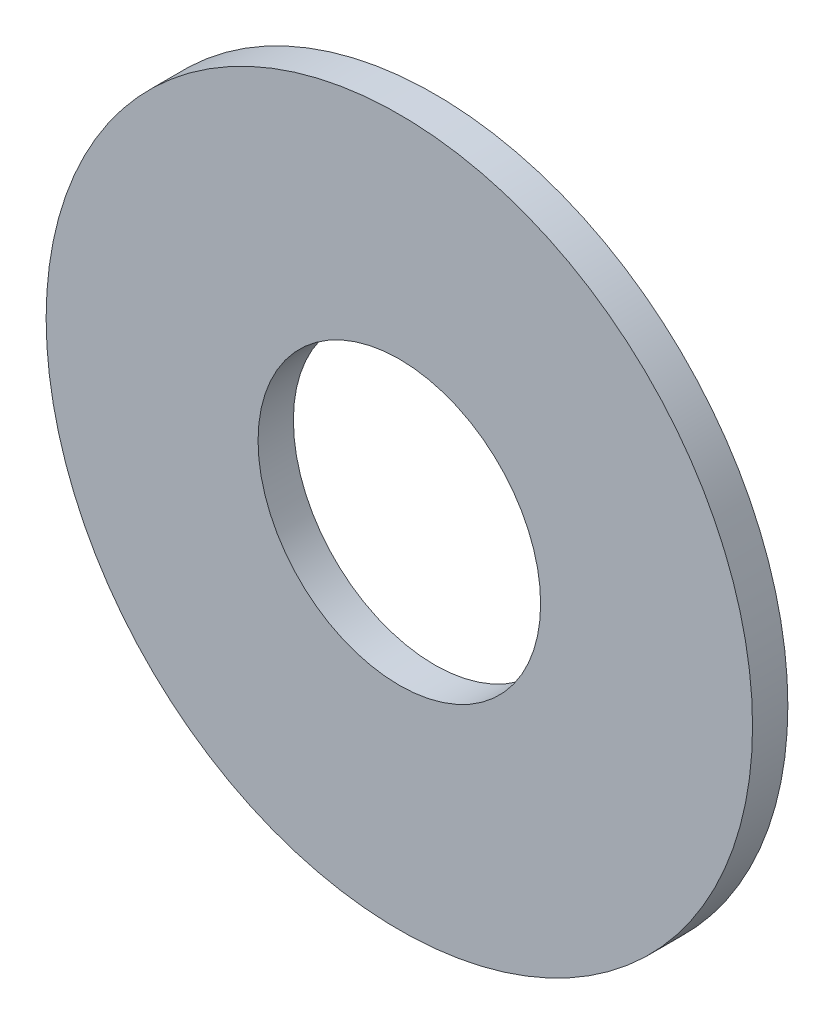
ISO-10303-21;
HEADER;
FILE_DESCRIPTION(('STEP AP214'),'2;1');
FILE_NAME('part.step','',(''),(''),'','','');
FILE_SCHEMA(('AUTOMOTIVE_DESIGN { 1 0 10303 214 1 1 1 1 }'));
ENDSEC;
DATA;
#1=APPLICATION_CONTEXT('core data for automotive mechanical design processes');
#2=APPLICATION_PROTOCOL_DEFINITION('international standard','automotive_design',2000,#1);
#3=PRODUCT_CONTEXT('',#1,'mechanical');
#4=PRODUCT('Part','Part','',(#3));
#5=PRODUCT_RELATED_PRODUCT_CATEGORY('part','',(#4));
#6=PRODUCT_DEFINITION_FORMATION('','',#4);
#7=PRODUCT_DEFINITION_CONTEXT('part definition',#1,'design');
#8=PRODUCT_DEFINITION('design','',#6,#7);
#9=PRODUCT_DEFINITION_SHAPE('','',#8);
#10=(LENGTH_UNIT() NAMED_UNIT(*) SI_UNIT(.MILLI.,.METRE.));
#11=(NAMED_UNIT(*) PLANE_ANGLE_UNIT() SI_UNIT($,.RADIAN.));
#12=(NAMED_UNIT(*) SI_UNIT($,.STERADIAN.) SOLID_ANGLE_UNIT());
#13=UNCERTAINTY_MEASURE_WITH_UNIT(LENGTH_MEASURE(1.E-05),#10,'distance_accuracy_value','');
#14=(GEOMETRIC_REPRESENTATION_CONTEXT(3) GLOBAL_UNCERTAINTY_ASSIGNED_CONTEXT((#13)) GLOBAL_UNIT_ASSIGNED_CONTEXT((#10,
#11,#12)) REPRESENTATION_CONTEXT('',''));
#15=CARTESIAN_POINT('',(0.,0.,0.));
#16=DIRECTION('',(0.,0.,1.));
#17=DIRECTION('',(1.,0.,0.));
#18=AXIS2_PLACEMENT_3D('',#15,#16,#17);
#19=CARTESIAN_POINT('',(0.,0.,1.));
#20=DIRECTION('',(0.,0.,1.));
#21=DIRECTION('',(1.,0.,0.));
#22=AXIS2_PLACEMENT_3D('',#19,#20,#21);
#23=PLANE('',#22);
#24=CARTESIAN_POINT('',(0.,0.,1.));
#25=DIRECTION('',(0.,0.,1.));
#26=DIRECTION('',(1.,0.,0.));
#27=AXIS2_PLACEMENT_3D('',#24,#25,#26);
#28=CIRCLE('',#27,10.);
#29=CARTESIAN_POINT('',(10.,0.,1.));
#30=VERTEX_POINT('',#29);
#31=EDGE_CURVE('E10',#30,#30,#28,.T.);
#32=ORIENTED_EDGE('',*,*,#31,.T.);
#33=EDGE_LOOP('',(#32));
#34=FACE_BOUND('',#33,.T.);
#35=CARTESIAN_POINT('',(0.,0.,1.));
#36=DIRECTION('',(0.,0.,1.));
#37=DIRECTION('',(1.,0.,0.));
#38=AXIS2_PLACEMENT_3D('',#35,#36,#37);
#39=CIRCLE('',#38,4.);
#40=CARTESIAN_POINT('',(4.,0.,1.));
#41=VERTEX_POINT('',#40);
#42=EDGE_CURVE('E42',#41,#41,#39,.T.);
#43=ORIENTED_EDGE('',*,*,#42,.F.);
#44=EDGE_LOOP('',(#43));
#45=FACE_BOUND('',#44,.T.);
#46=ADVANCED_FACE('F31',(#34,#45),#23,.T.);
#47=CARTESIAN_POINT('',(0.,0.,0.));
#48=DIRECTION('',(0.,0.,1.));
#49=DIRECTION('',(1.,0.,0.));
#50=AXIS2_PLACEMENT_3D('',#47,#48,#49);
#51=PLANE('',#50);
#52=CARTESIAN_POINT('',(0.,0.,0.));
#53=DIRECTION('',(0.,0.,1.));
#54=DIRECTION('',(1.,0.,0.));
#55=AXIS2_PLACEMENT_3D('',#52,#53,#54);
#56=CIRCLE('',#55,10.);
#57=CARTESIAN_POINT('',(10.,0.,0.));
#58=VERTEX_POINT('',#57);
#59=EDGE_CURVE('E35',#58,#58,#56,.T.);
#60=ORIENTED_EDGE('',*,*,#59,.F.);
#61=EDGE_LOOP('',(#60));
#62=FACE_BOUND('',#61,.T.);
#63=CARTESIAN_POINT('',(0.,0.,0.));
#64=DIRECTION('',(0.,0.,1.));
#65=DIRECTION('',(1.,0.,0.));
#66=AXIS2_PLACEMENT_3D('',#63,#64,#65);
#67=CIRCLE('',#66,4.);
#68=CARTESIAN_POINT('',(4.,0.,0.));
#69=VERTEX_POINT('',#68);
#70=EDGE_CURVE('E44',#69,#69,#67,.T.);
#71=ORIENTED_EDGE('',*,*,#70,.T.);
#72=EDGE_LOOP('',(#71));
#73=FACE_BOUND('',#72,.T.);
#74=ADVANCED_FACE('F54',(#62,#73),#51,.F.);
#75=CARTESIAN_POINT('',(0.,0.,1.));
#76=DIRECTION('',(0.,0.,-1.));
#77=DIRECTION('',(-1.,0.,0.));
#78=AXIS2_PLACEMENT_3D('',#75,#76,#77);
#79=CYLINDRICAL_SURFACE('',#78,10.);
#80=ORIENTED_EDGE('',*,*,#31,.F.);
#81=EDGE_LOOP('',(#80));
#82=FACE_BOUND('',#81,.T.);
#83=ORIENTED_EDGE('',*,*,#59,.T.);
#84=EDGE_LOOP('',(#83));
#85=FACE_BOUND('',#84,.T.);
#86=ADVANCED_FACE('F33',(#82,#85),#79,.T.);
#87=CARTESIAN_POINT('',(0.,0.,1.));
#88=DIRECTION('',(0.,0.,-1.));
#89=DIRECTION('',(-1.,0.,0.));
#90=AXIS2_PLACEMENT_3D('',#87,#88,#89);
#91=CYLINDRICAL_SURFACE('',#90,4.);
#92=ORIENTED_EDGE('',*,*,#42,.T.);
#93=EDGE_LOOP('',(#92));
#94=FACE_BOUND('',#93,.T.);
#95=ORIENTED_EDGE('',*,*,#70,.F.);
#96=EDGE_LOOP('',(#95));
#97=FACE_BOUND('',#96,.T.);
#98=ADVANCED_FACE('F50',(#94,#97),#91,.F.);
#99=CLOSED_SHELL('',(#46,#74,#86,#98));
#100=MANIFOLD_SOLID_BREP('B2',#99);
#101=ADVANCED_BREP_SHAPE_REPRESENTATION('',(#18,#100),#14);
#102=SHAPE_DEFINITION_REPRESENTATION(#9,#101);
ENDSEC;
END-ISO-10303-21;
